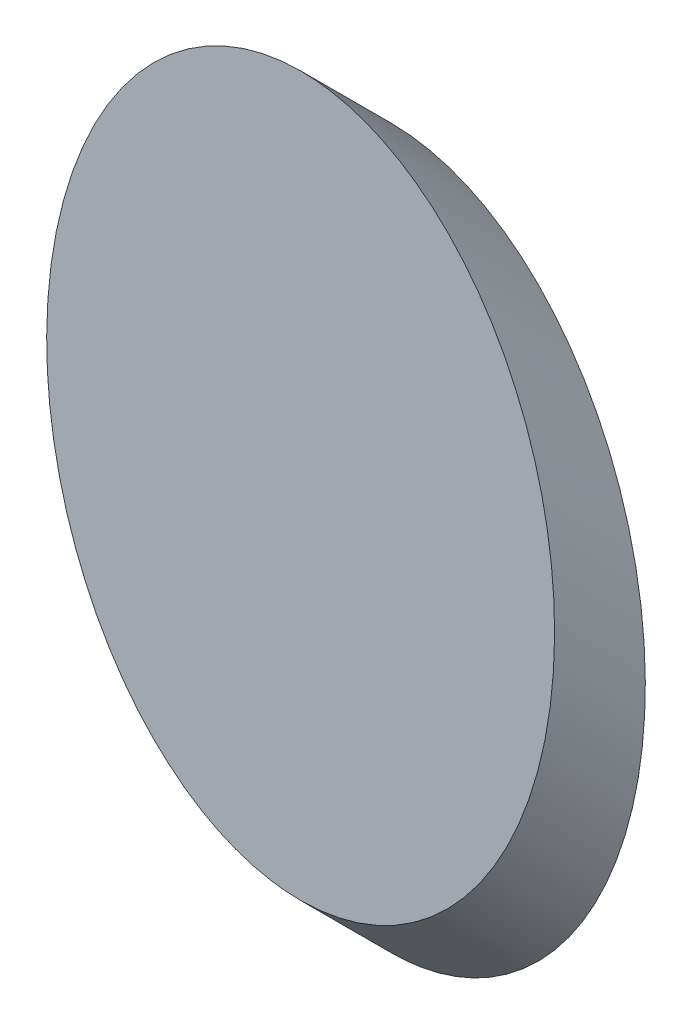
ISO-10303-21;
HEADER;
FILE_DESCRIPTION(('STEP AP214'),'2;1');
FILE_NAME('part.step','',(''),(''),'','','');
FILE_SCHEMA(('AUTOMOTIVE_DESIGN { 1 0 10303 214 1 1 1 1 }'));
ENDSEC;
DATA;
#1=APPLICATION_CONTEXT('core data for automotive mechanical design processes');
#2=APPLICATION_PROTOCOL_DEFINITION('international standard','automotive_design',2000,#1);
#3=PRODUCT_CONTEXT('',#1,'mechanical');
#4=PRODUCT('Part','Part','',(#3));
#5=PRODUCT_RELATED_PRODUCT_CATEGORY('part','',(#4));
#6=PRODUCT_DEFINITION_FORMATION('','',#4);
#7=PRODUCT_DEFINITION_CONTEXT('part definition',#1,'design');
#8=PRODUCT_DEFINITION('design','',#6,#7);
#9=PRODUCT_DEFINITION_SHAPE('','',#8);
#10=(LENGTH_UNIT() NAMED_UNIT(*) SI_UNIT(.MILLI.,.METRE.));
#11=(NAMED_UNIT(*) PLANE_ANGLE_UNIT() SI_UNIT($,.RADIAN.));
#12=(NAMED_UNIT(*) SI_UNIT($,.STERADIAN.) SOLID_ANGLE_UNIT());
#13=UNCERTAINTY_MEASURE_WITH_UNIT(LENGTH_MEASURE(1.E-05),#10,'distance_accuracy_value','');
#14=(GEOMETRIC_REPRESENTATION_CONTEXT(3) GLOBAL_UNCERTAINTY_ASSIGNED_CONTEXT((#13)) GLOBAL_UNIT_ASSIGNED_CONTEXT((#10,
#11,#12)) REPRESENTATION_CONTEXT('',''));
#15=CARTESIAN_POINT('',(0.,0.,0.));
#16=DIRECTION('',(0.,0.,1.));
#17=DIRECTION('',(1.,0.,0.));
#18=AXIS2_PLACEMENT_3D('',#15,#16,#17);
#19=CARTESIAN_POINT('',(54.3923829817161,35.7888715303221,0.));
#20=DIRECTION('',(0.,0.,1.));
#21=DIRECTION('',(1.,0.,0.));
#22=AXIS2_PLACEMENT_3D('',#19,#20,#21);
#23=PLANE('',#22);
#24=CARTESIAN_POINT('',(54.3923829817161,85.2938715303221,0.));
#25=CARTESIAN_POINT('',(54.6443985447412,85.2938728925278,0.));
#26=CARTESIAN_POINT('',(54.8963980411833,85.2900210593287,0.));
#27=CARTESIAN_POINT('',(55.4001597484142,85.2746286149493,0.));
#28=CARTESIAN_POINT('',(55.6519219614505,85.2630880773457,0.));
#29=CARTESIAN_POINT('',(56.4061621275623,85.2169835592146,0.));
#30=CARTESIAN_POINT('',(56.9079850265845,85.1709366117481,0.));
#31=CARTESIAN_POINT('',(57.9077869689775,85.0486429635089,0.));
#32=CARTESIAN_POINT('',(58.4057668175211,84.9724027739777,0.));
#33=CARTESIAN_POINT('',(59.3925580636411,84.7910939806968,0.));
#34=CARTESIAN_POINT('',(59.8814103036819,84.6862475003387,0.));
#35=CARTESIAN_POINT('',(60.8522546597314,84.448355346235,0.));
#36=CARTESIAN_POINT('',(61.3342460040687,84.3153065267928,0.));
#37=CARTESIAN_POINT('',(62.2898694689035,84.0221057479046,0.));
#38=CARTESIAN_POINT('',(62.7635016888445,83.8619541111248,0.));
#39=CARTESIAN_POINT('',(63.9018929890761,83.4416351591114,0.));
#40=CARTESIAN_POINT('',(64.5617165005626,83.16799420347,0.));
#41=CARTESIAN_POINT('',(65.8586915787453,82.5718080371783,0.));
#42=CARTESIAN_POINT('',(66.4958448099594,82.2492664261427,0.));
#43=CARTESIAN_POINT('',(67.7463755698019,81.5587427005777,0.));
#44=CARTESIAN_POINT('',(68.3597117360352,81.1906858054619,0.));
#45=CARTESIAN_POINT('',(69.5598871820921,80.4136470374011,0.));
#46=CARTESIAN_POINT('',(70.1467223854414,80.0046588991728,0.));
#47=CARTESIAN_POINT('',(71.5706549342058,78.9424359011664,0.));
#48=CARTESIAN_POINT('',(72.3911980110697,78.2668945292467,0.));
#49=CARTESIAN_POINT('',(73.9697903506671,76.8463283169203,0.));
#50=CARTESIAN_POINT('',(74.7278158550472,76.101277288125,0.));
#51=CARTESIAN_POINT('',(76.1822996640202,74.551181733507,0.));
#52=CARTESIAN_POINT('',(76.8786538686018,73.7460398424123,0.));
#53=CARTESIAN_POINT('',(78.2091834922956,72.0861800402119,0.));
#54=CARTESIAN_POINT('',(78.8433578358314,71.2314612719407,0.));
#55=CARTESIAN_POINT('',(80.2834766163629,69.1431770846754,0.));
#56=CARTESIAN_POINT('',(81.0616215729733,67.8903850663276,0.));
#57=CARTESIAN_POINT('',(82.5060829951381,65.3218784650116,0.));
#58=CARTESIAN_POINT('',(83.1723587012572,64.0061411713847,0.));
#59=CARTESIAN_POINT('',(84.3980264676188,61.3245582799203,0.));
#60=CARTESIAN_POINT('',(84.9573201673968,59.9586679327406,0.));
#61=CARTESIAN_POINT('',(85.9724417535922,57.1891338202383,0.));
#62=CARTESIAN_POINT('',(86.4282701379718,55.7854902366524,0.));
#63=CARTESIAN_POINT('',(87.1814970772061,53.1541509684229,0.));
#64=CARTESIAN_POINT('',(87.4922598007684,51.9302443755278,0.));
#65=CARTESIAN_POINT('',(88.0424637153077,49.4662283126502,0.));
#66=CARTESIAN_POINT('',(88.281888682508,48.2261152237894,0.));
#67=CARTESIAN_POINT('',(88.6907343495945,45.734313015362,0.));
#68=CARTESIAN_POINT('',(88.8601476895396,44.4826226928776,0.));
#69=CARTESIAN_POINT('',(89.1300793745773,41.9704548931022,0.));
#70=CARTESIAN_POINT('',(89.2305213596397,40.7099692322469,0.));
#71=CARTESIAN_POINT('',(89.3627906172329,38.1855662685727,0.));
#72=CARTESIAN_POINT('',(89.394626149866,36.9216493972148,0.));
#73=CARTESIAN_POINT('',(89.3898945060115,34.3939736856298,0.));
#74=CARTESIAN_POINT('',(89.3533289172044,33.1302148424156,0.));
#75=CARTESIAN_POINT('',(89.2109931647294,30.5960349025475,0.));
#76=CARTESIAN_POINT('',(89.1046496598722,29.3256458752762,0.));
#77=CARTESIAN_POINT('',(88.8215593036046,26.7926543139426,0.));
#78=CARTESIAN_POINT('',(88.6448092053139,25.5300521417072,0.));
#79=CARTESIAN_POINT('',(88.2198029930001,23.0166179116179,0.));
#80=CARTESIAN_POINT('',(87.9715312561693,21.7657884870524,0.));
#81=CARTESIAN_POINT('',(87.402503566296,19.2829211033606,0.));
#82=CARTESIAN_POINT('',(87.0818721391739,18.0508546976872,0.));
#83=CARTESIAN_POINT('',(86.3660638571956,15.608740086674,0.));
#84=CARTESIAN_POINT('',(85.9709005818881,14.3986879143532,0.));
#85=CARTESIAN_POINT('',(85.1038998503381,12.0069007798385,0.));
#86=CARTESIAN_POINT('',(84.6320985098779,10.8251527788107,0.));
#87=CARTESIAN_POINT('',(83.6260127273844,8.53503218896136,0.));
#88=CARTESIAN_POINT('',(83.0943166804122,7.42552578105183,0.));
#89=CARTESIAN_POINT('',(81.9540707724586,5.24666040622734,0.));
#90=CARTESIAN_POINT('',(81.3455269304391,4.17729830358399,0.));
#91=CARTESIAN_POINT('',(80.0495931283311,2.08889887779427,0.));
#92=CARTESIAN_POINT('',(79.3622901632763,1.06980777377196,0.));
#93=CARTESIAN_POINT('',(77.905896129219,-0.908214040107838,0.));
#94=CARTESIAN_POINT('',(77.1368256127269,-1.86715977178266,0.));
#95=CARTESIAN_POINT('',(75.7079907766956,-3.49238152079036,0.));
#96=CARTESIAN_POINT('',(75.0656969665354,-4.17404402117954,0.));
#97=CARTESIAN_POINT('',(73.732243175316,-5.48797011506033,0.));
#98=CARTESIAN_POINT('',(73.0410855477913,-6.12023608466096,0.));
#99=CARTESIAN_POINT('',(71.6109806283683,-7.32714211647898,0.));
#100=CARTESIAN_POINT('',(70.8720715900618,-7.90182738780712,0.));
#101=CARTESIAN_POINT('',(69.347480926134,-8.98560640199208,0.));
#102=CARTESIAN_POINT('',(68.5618097091627,-9.49471466219703,0.));
#103=CARTESIAN_POINT('',(67.317046698747,-10.2219768971299,0.));
#104=CARTESIAN_POINT('',(66.8732425392611,-10.466570595856,0.));
#105=CARTESIAN_POINT('',(65.9735172942795,-10.9323978152807,0.));
#106=CARTESIAN_POINT('',(65.5175969578221,-11.1536327758617,0.));
#107=CARTESIAN_POINT('',(64.5944839167033,-11.5713003841581,0.));
#108=CARTESIAN_POINT('',(64.1272903450458,-11.7677311169549,0.));
#109=CARTESIAN_POINT('',(63.1835434149852,-12.1340575964342,0.));
#110=CARTESIAN_POINT('',(62.7070080498584,-12.3039996073134,0.));
#111=CARTESIAN_POINT('',(61.7450507781631,-12.6164577368179,0.));
#112=CARTESIAN_POINT('',(61.2596294211374,-12.7589755452246,0.));
#113=CARTESIAN_POINT('',(60.2814668398238,-13.0153908154112,0.));
#114=CARTESIAN_POINT('',(59.7887286294858,-13.1292997333507,0.));
#115=CARTESIAN_POINT('',(58.8900862181598,-13.3090459610826,0.));
#116=CARTESIAN_POINT('',(58.4851765604554,-13.3798894895104,0.));
#117=CARTESIAN_POINT('',(57.6723743986767,-13.5016540773231,0.));
#118=CARTESIAN_POINT('',(57.2644819919669,-13.5525757840749,0.));
#119=CARTESIAN_POINT('',(56.4464575119767,-13.6342039837025,0.));
#120=CARTESIAN_POINT('',(56.0363243543418,-13.6648996144551,0.));
#121=CARTESIAN_POINT('',(55.2149241357862,-13.7058759006965,0.));
#122=CARTESIAN_POINT('',(54.8036567870657,-13.7161507818981,0.));
#123=CARTESIAN_POINT('',(54.392382981716,-13.7161284696779,0.));
#124=B_SPLINE_CURVE_WITH_KNOTS('',3,(#24,#25,#26,#27,#28,#29,#30,#31,#32,#33,#34,#35,#36,#37,
#38,#39,#40,#41,#42,#43,#44,#45,#46,#47,#48,#49,#50,#51,#52,#53,#54,#55,#56,#57,#58,#59,#60,#61,
#62,#63,#64,#65,#66,#67,#68,#69,#70,#71,#72,#73,#74,#75,#76,#77,#78,#79,#80,#81,#82,#83,#84,#85,
#86,#87,#88,#89,#90,#91,#92,#93,#94,#95,#96,#97,#98,#99,#100,#101,#102,#103,#104,#105,#106,#107,
#108,#109,#110,#111,#112,#113,#114,#115,#116,#117,#118,#119,#120,#121,#122,#123),.UNSPECIFIED.,
.F.,.F.,(4,2,2,2,2,2,2,2,2,2,2,2,2,2,2,2,2,2,2,2,2,2,2,2,2,2,2,2,2,2,2,2,2,2,2,2,2,2,2,2,2,2,2,
2,2,2,2,2,2,4),(0.,0.755985304328775,1.5119633743747,3.02274723751171,4.53320547392342,
6.03225355449805,7.53146892737502,9.03066645295187,11.171352723961,13.3118814938488,
15.4559750308573,17.6003972644477,20.7841451269208,23.9690973767389,27.1593271863399,
30.3496121702505,34.7674558507095,39.1869056909556,43.6103994956663,48.0338720103486,
51.8199842280139,55.6069568348979,59.3943274443868,63.1858844217277,66.9769848764245,
70.7679973357571,74.5905560083879,78.4132909830906,82.2368616097404,86.0539016505004,
89.870246905086,93.6847988922086,97.3729551506642,101.060822720038,104.744655345873,
108.427564209026,111.235058336098,114.042417331722,116.84755458519,119.652069770032,
121.171721344642,122.69127918993,124.210954275429,125.727944671985,127.244841567059,
128.761130063152,129.993842419178,131.226514714438,132.459848460263,133.693530900952),.UNSPECIFIED.);
#125=CARTESIAN_POINT('',(54.3923829817161,85.2938715303221,0.));
#126=VERTEX_POINT('',#125);
#127=CARTESIAN_POINT('',(54.392382981716,-13.7161284696779,0.));
#128=VERTEX_POINT('',#127);
#129=EDGE_CURVE('E47',#126,#128,#124,.T.);
#130=ORIENTED_EDGE('',*,*,#129,.T.);
#131=CARTESIAN_POINT('',(54.392382981716,-13.7161284696779,0.));
#132=CARTESIAN_POINT('',(54.1403674186909,-13.7161298318835,0.));
#133=CARTESIAN_POINT('',(53.8883679222488,-13.7122779986845,0.));
#134=CARTESIAN_POINT('',(53.3846062150179,-13.696885554305,0.));
#135=CARTESIAN_POINT('',(53.1328440019816,-13.6853450167015,0.));
#136=CARTESIAN_POINT('',(52.3786038358698,-13.6392404985704,0.));
#137=CARTESIAN_POINT('',(51.8767809368476,-13.5931935511039,0.));
#138=CARTESIAN_POINT('',(50.8769789944546,-13.4708999028647,0.));
#139=CARTESIAN_POINT('',(50.378999145911,-13.3946597133335,0.));
#140=CARTESIAN_POINT('',(49.392207899791,-13.2133509200526,0.));
#141=CARTESIAN_POINT('',(48.9033556597502,-13.1085044396945,0.));
#142=CARTESIAN_POINT('',(47.9325113037007,-12.8706122855908,0.));
#143=CARTESIAN_POINT('',(47.4505199593634,-12.7375634661486,0.));
#144=CARTESIAN_POINT('',(46.4948964945286,-12.4443626872604,0.));
#145=CARTESIAN_POINT('',(46.0212642745876,-12.2842110504806,0.));
#146=CARTESIAN_POINT('',(44.882872974356,-11.8638920984672,0.));
#147=CARTESIAN_POINT('',(44.2230494628695,-11.5902511428258,0.));
#148=CARTESIAN_POINT('',(42.9260743846868,-10.9940649765341,0.));
#149=CARTESIAN_POINT('',(42.2889211534728,-10.6715233654984,0.));
#150=CARTESIAN_POINT('',(41.0383903936302,-9.98099963993353,0.));
#151=CARTESIAN_POINT('',(40.425054227397,-9.61294274481765,0.));
#152=CARTESIAN_POINT('',(39.22487878134,-8.83590397675692,0.));
#153=CARTESIAN_POINT('',(38.6380435779907,-8.42691583852856,0.));
#154=CARTESIAN_POINT('',(37.2141110292263,-7.36469284052221,0.));
#155=CARTESIAN_POINT('',(36.3935679523624,-6.68915146860244,0.));
#156=CARTESIAN_POINT('',(34.814975612765,-5.26858525627603,0.));
#157=CARTESIAN_POINT('',(34.0569501083849,-4.52353422748075,0.));
#158=CARTESIAN_POINT('',(32.6024662994118,-2.9734386728628,0.));
#159=CARTESIAN_POINT('',(31.9061120948303,-2.16829678176812,0.));
#160=CARTESIAN_POINT('',(30.5755824711365,-0.508436979567625,0.));
#161=CARTESIAN_POINT('',(29.9414081276007,0.346281788703523,0.));
#162=CARTESIAN_POINT('',(28.5012893470692,2.43456597596881,0.));
#163=CARTESIAN_POINT('',(27.7231443904588,3.68735799431661,0.));
#164=CARTESIAN_POINT('',(26.2786829682939,6.25586459563269,0.));
#165=CARTESIAN_POINT('',(25.6124072621749,7.57160188925952,0.));
#166=CARTESIAN_POINT('',(24.3867394958132,10.253184780724,0.));
#167=CARTESIAN_POINT('',(23.8274457960353,11.6190751279036,0.));
#168=CARTESIAN_POINT('',(22.8123242098399,14.3886092404059,0.));
#169=CARTESIAN_POINT('',(22.3564958254603,15.7922528239919,0.));
#170=CARTESIAN_POINT('',(21.603268886226,18.4235920922214,0.));
#171=CARTESIAN_POINT('',(21.2925061626636,19.6474986851165,0.));
#172=CARTESIAN_POINT('',(20.7423022481244,22.1115147479941,0.));
#173=CARTESIAN_POINT('',(20.5028772809241,23.3516278368549,0.));
#174=CARTESIAN_POINT('',(20.0940316138375,25.8434300452823,0.));
#175=CARTESIAN_POINT('',(19.9246182738925,27.0951203677667,0.));
#176=CARTESIAN_POINT('',(19.6546865888547,29.6072881675421,0.));
#177=CARTESIAN_POINT('',(19.5542446037924,30.8677738283974,0.));
#178=CARTESIAN_POINT('',(19.4219753461992,33.3921767920716,0.));
#179=CARTESIAN_POINT('',(19.3901398135661,34.6560936634295,0.));
#180=CARTESIAN_POINT('',(19.3948714574205,37.1837693750145,0.));
#181=CARTESIAN_POINT('',(19.4314370462277,38.4475282182287,0.));
#182=CARTESIAN_POINT('',(19.5737727987027,40.9817081580968,0.));
#183=CARTESIAN_POINT('',(19.68011630356,42.2520971853681,0.));
#184=CARTESIAN_POINT('',(19.9632066598275,44.7850887467017,0.));
#185=CARTESIAN_POINT('',(20.1399567581182,46.0476909189371,0.));
#186=CARTESIAN_POINT('',(20.564962970432,48.5611251490264,0.));
#187=CARTESIAN_POINT('',(20.8132347072628,49.8119545735919,0.));
#188=CARTESIAN_POINT('',(21.3822623971361,52.2948219572836,0.));
#189=CARTESIAN_POINT('',(21.7028938242582,53.5268883629571,0.));
#190=CARTESIAN_POINT('',(22.4187021062366,55.9690029739703,0.));
#191=CARTESIAN_POINT('',(22.813865381544,57.1790551462911,0.));
#192=CARTESIAN_POINT('',(23.680866113094,59.5708422808058,0.));
#193=CARTESIAN_POINT('',(24.1526674535542,60.7525902818336,0.));
#194=CARTESIAN_POINT('',(25.1587532360478,63.0427108716829,0.));
#195=CARTESIAN_POINT('',(25.69044928302,64.1522172795925,0.));
#196=CARTESIAN_POINT('',(26.8306951909735,66.3310826544169,0.));
#197=CARTESIAN_POINT('',(27.439239032993,67.4004447570603,0.));
#198=CARTESIAN_POINT('',(28.735172835101,69.48884418285,0.));
#199=CARTESIAN_POINT('',(29.4224758001559,70.5079352868723,0.));
#200=CARTESIAN_POINT('',(30.8788698342131,72.4859571007521,0.));
#201=CARTESIAN_POINT('',(31.6479403507053,73.4449028324269,0.));
#202=CARTESIAN_POINT('',(33.0767751867366,75.0701245814346,0.));
#203=CARTESIAN_POINT('',(33.7190689968967,75.7517870818238,0.));
#204=CARTESIAN_POINT('',(35.0525227881161,77.0657131757046,0.));
#205=CARTESIAN_POINT('',(35.7436804156409,77.6979791453052,0.));
#206=CARTESIAN_POINT('',(37.1737853350638,78.9048851771232,0.));
#207=CARTESIAN_POINT('',(37.9126943733704,79.4795704484513,0.));
#208=CARTESIAN_POINT('',(39.4372850372982,80.5633494626363,0.));
#209=CARTESIAN_POINT('',(40.2229562542694,81.0724577228413,0.));
#210=CARTESIAN_POINT('',(41.4677192646851,81.7997199577741,0.));
#211=CARTESIAN_POINT('',(41.9115234241711,82.0443136565002,0.));
#212=CARTESIAN_POINT('',(42.8112486691526,82.5101408759249,0.));
#213=CARTESIAN_POINT('',(43.26716900561,82.7313758365059,0.));
#214=CARTESIAN_POINT('',(44.1902820467288,83.1490434448023,0.));
#215=CARTESIAN_POINT('',(44.6574756183863,83.3454741775991,0.));
#216=CARTESIAN_POINT('',(45.6012225484469,83.7118006570784,0.));
#217=CARTESIAN_POINT('',(46.0777579135737,83.8817426679576,0.));
#218=CARTESIAN_POINT('',(47.039715185269,84.1942007974621,0.));
#219=CARTESIAN_POINT('',(47.5251365422947,84.3367186058689,0.));
#220=CARTESIAN_POINT('',(48.5032991236083,84.5931338760554,0.));
#221=CARTESIAN_POINT('',(48.9960373339463,84.7070427939949,0.));
#222=CARTESIAN_POINT('',(49.8946797452723,84.8867890217268,0.));
#223=CARTESIAN_POINT('',(50.2995894029767,84.9576325501546,0.));
#224=CARTESIAN_POINT('',(51.1123915647554,85.0793971379673,0.));
#225=CARTESIAN_POINT('',(51.5202839714652,85.1303188447191,0.));
#226=CARTESIAN_POINT('',(52.3383084514554,85.2119470443468,0.));
#227=CARTESIAN_POINT('',(52.7484416090903,85.2426426750994,0.));
#228=CARTESIAN_POINT('',(53.5698418276459,85.2836189613407,0.));
#229=CARTESIAN_POINT('',(53.9811091763664,85.2938938425423,0.));
#230=CARTESIAN_POINT('',(54.3923829817161,85.2938715303221,0.));
#231=B_SPLINE_CURVE_WITH_KNOTS('',3,(#131,#132,#133,#134,#135,#136,#137,#138,#139,#140,#141,
#142,#143,#144,#145,#146,#147,#148,#149,#150,#151,#152,#153,#154,#155,#156,#157,#158,#159,#160,
#161,#162,#163,#164,#165,#166,#167,#168,#169,#170,#171,#172,#173,#174,#175,#176,#177,#178,#179,
#180,#181,#182,#183,#184,#185,#186,#187,#188,#189,#190,#191,#192,#193,#194,#195,#196,#197,#198,
#199,#200,#201,#202,#203,#204,#205,#206,#207,#208,#209,#210,#211,#212,#213,#214,#215,#216,#217,
#218,#219,#220,#221,#222,#223,#224,#225,#226,#227,#228,#229,#230),.UNSPECIFIED.,.F.,.F.,(4,2,2,
2,2,2,2,2,2,2,2,2,2,2,2,2,2,2,2,2,2,2,2,2,2,2,2,2,2,2,2,2,2,2,2,2,2,2,2,2,2,2,2,2,2,2,2,2,2,4),
(0.,0.755985304328782,1.5119633743747,3.0227472375117,4.53320547392341,6.03225355449806,
7.53146892737501,9.03066645295186,11.171352723961,13.3118814938488,15.4559750308573,
17.6003972644476,20.7841451269208,23.9690973767389,27.15932718634,30.3496121702505,
34.7674558507095,39.1869056909557,43.6103994956663,48.0338720103487,51.819984228014,
55.606956834898,59.3943274443868,63.1858844217278,66.9769848764245,70.7679973357572,
74.5905560083879,78.4132909830906,82.2368616097405,86.0539016505004,89.8702469050861,
93.6847988922087,97.3729551506643,101.060822720038,104.744655345873,108.427564209026,
111.235058336098,114.042417331722,116.84755458519,119.652069770032,121.171721344642,
122.69127918993,124.210954275429,125.727944671985,127.244841567059,128.761130063152,
129.993842419178,131.226514714438,132.459848460263,133.693530900952),.UNSPECIFIED.);
#232=EDGE_CURVE('E21',#128,#126,#231,.T.);
#233=ORIENTED_EDGE('',*,*,#232,.T.);
#234=EDGE_LOOP('',(#130,#233));
#235=FACE_BOUND('',#234,.T.);
#236=ADVANCED_FACE('F17',(#235),#23,.F.);
#237=CARTESIAN_POINT('',(54.3923829817161,97.7955194217003,12.5016478913781));
#238=CARTESIAN_POINT('',(54.3923829817161,85.2938715303221,0.));
#239=CARTESIAN_POINT('',(-15.6076170182839,97.7955194217003,12.5016478913781));
#240=CARTESIAN_POINT('',(-15.6076170182839,85.2938715303221,0.));
#241=CARTESIAN_POINT('',(-15.6076170182839,-1.21448057829968,12.5016478913781));
#242=CARTESIAN_POINT('',(-15.6076170182839,-13.7161284696779,0.));
#243=CARTESIAN_POINT('',(54.392382981716,-1.2144805782997,12.5016478913781));
#244=CARTESIAN_POINT('',(54.392382981716,-13.7161284696779,0.));
#245=(BOUNDED_SURFACE() B_SPLINE_SURFACE(3,1,((#237,#238),(#239,#240),(#241,#242),(#243,#244)),
.UNSPECIFIED.,.F.,.F.,.F.) B_SPLINE_SURFACE_WITH_KNOTS((4,4),(2,2),(0.,1.),(0.,1.),
.UNSPECIFIED.) GEOMETRIC_REPRESENTATION_ITEM() RATIONAL_B_SPLINE_SURFACE(((1.,1.),
(0.333333333333333,0.333333333333333),(0.333333333333333,0.333333333333333),(1.,1.))) REPRESENTATION_ITEM('') SURFACE());
#246=CARTESIAN_POINT('',(54.3923829817161,97.7955194217003,12.5016478913781));
#247=CARTESIAN_POINT('',(54.1403674186909,97.7955207839059,12.5016478913781));
#248=CARTESIAN_POINT('',(53.8883679222488,97.7916689507069,12.5016478913781));
#249=CARTESIAN_POINT('',(53.3846062150179,97.7762765063275,12.5016478913781));
#250=CARTESIAN_POINT('',(53.1328440019816,97.7647359687239,12.5016478913781));
#251=CARTESIAN_POINT('',(52.3786038358698,97.7186314505928,12.5016478913781));
#252=CARTESIAN_POINT('',(51.8767809368476,97.6725845031263,12.5016478913781));
#253=CARTESIAN_POINT('',(50.8769789944546,97.5502908548871,12.5016478913781));
#254=CARTESIAN_POINT('',(50.378999145911,97.4740506653559,12.5016478913781));
#255=CARTESIAN_POINT('',(49.392207899791,97.292741872075,12.5016478913781));
#256=CARTESIAN_POINT('',(48.9033556597502,97.1878953917169,12.5016478913781));
#257=CARTESIAN_POINT('',(47.9325113037007,96.9500032376132,12.5016478913781));
#258=CARTESIAN_POINT('',(47.4505199593634,96.816954418171,12.5016478913781));
#259=CARTESIAN_POINT('',(46.4948964945286,96.5237536392828,12.5016478913781));
#260=CARTESIAN_POINT('',(46.0212642745876,96.363602002503,12.5016478913781));
#261=CARTESIAN_POINT('',(44.882872974356,95.9432830504896,12.5016478913781));
#262=CARTESIAN_POINT('',(44.2230494628695,95.6696420948482,12.5016478913781));
#263=CARTESIAN_POINT('',(42.9260743846868,95.0734559285565,12.5016478913781));
#264=CARTESIAN_POINT('',(42.2889211534728,94.7509143175209,12.5016478913781));
#265=CARTESIAN_POINT('',(41.0383903936302,94.060390591956,12.5016478913781));
#266=CARTESIAN_POINT('',(40.425054227397,93.6923336968401,12.5016478913781));
#267=CARTESIAN_POINT('',(39.22487878134,92.9152949287793,12.5016478913781));
#268=CARTESIAN_POINT('',(38.6380435779907,92.506306790551,12.5016478913781));
#269=CARTESIAN_POINT('',(37.2141110292263,91.4440837925446,12.5016478913781));
#270=CARTESIAN_POINT('',(36.3935679523624,90.7685424206249,12.5016478913781));
#271=CARTESIAN_POINT('',(34.814975612765,89.3479762082985,12.5016478913781));
#272=CARTESIAN_POINT('',(34.0569501083849,88.6029251795032,12.5016478913781));
#273=CARTESIAN_POINT('',(32.6024662994119,87.0528296248852,12.5016478913781));
#274=CARTESIAN_POINT('',(31.9061120948303,86.2476877337906,12.5016478913781));
#275=CARTESIAN_POINT('',(30.5755824711365,84.5878279315901,12.5016478913781));
#276=CARTESIAN_POINT('',(29.9414081276007,83.7331091633189,12.5016478913781));
#277=CARTESIAN_POINT('',(28.5012893470692,81.6448249760537,12.5016478913781));
#278=CARTESIAN_POINT('',(27.7231443904588,80.3920329577059,12.5016478913781));
#279=CARTESIAN_POINT('',(26.278682968294,77.8235263563898,12.5016478913781));
#280=CARTESIAN_POINT('',(25.6124072621749,76.5077890627629,12.5016478913781));
#281=CARTESIAN_POINT('',(24.3867394958133,73.8262061712985,12.5016478913781));
#282=CARTESIAN_POINT('',(23.8274457960353,72.4603158241188,12.5016478913781));
#283=CARTESIAN_POINT('',(22.8123242098399,69.6907817116165,12.5016478913781));
#284=CARTESIAN_POINT('',(22.3564958254603,68.2871381280306,12.5016478913781));
#285=CARTESIAN_POINT('',(21.603268886226,65.6557988598011,12.5016478913781));
#286=CARTESIAN_POINT('',(21.2925061626637,64.431892266906,12.5016478913781));
#287=CARTESIAN_POINT('',(20.7423022481244,61.9678762040284,12.5016478913781));
#288=CARTESIAN_POINT('',(20.5028772809241,60.7277631151676,12.5016478913781));
#289=CARTESIAN_POINT('',(20.0940316138376,58.2359609067402,12.5016478913781));
#290=CARTESIAN_POINT('',(19.9246182738925,56.9842705842558,12.5016478913781));
#291=CARTESIAN_POINT('',(19.6546865888548,54.4721027844804,12.5016478913781));
#292=CARTESIAN_POINT('',(19.5542446037924,53.2116171236251,12.5016478913781));
#293=CARTESIAN_POINT('',(19.4219753461992,50.6872141599509,12.5016478913781));
#294=CARTESIAN_POINT('',(19.3901398135661,49.423297288593,12.5016478913781));
#295=CARTESIAN_POINT('',(19.3948714574205,46.895621577008,12.5016478913781));
#296=CARTESIAN_POINT('',(19.4314370462277,45.6318627337938,12.5016478913781));
#297=CARTESIAN_POINT('',(19.5737727987027,43.0976827939257,12.5016478913781));
#298=CARTESIAN_POINT('',(19.68011630356,41.8272937666544,12.5016478913781));
#299=CARTESIAN_POINT('',(19.9632066598275,39.2943022053208,12.5016478913781));
#300=CARTESIAN_POINT('',(20.1399567581182,38.0317000330854,12.5016478913781));
#301=CARTESIAN_POINT('',(20.564962970432,35.5182658029961,12.5016478913781));
#302=CARTESIAN_POINT('',(20.8132347072628,34.2674363784306,12.5016478913781));
#303=CARTESIAN_POINT('',(21.3822623971361,31.7845689947388,12.5016478913781));
#304=CARTESIAN_POINT('',(21.7028938242582,30.5525025890654,12.5016478913781));
#305=CARTESIAN_POINT('',(22.4187021062365,28.1103879780522,12.5016478913781));
#306=CARTESIAN_POINT('',(22.8138653815439,26.9003358057313,12.5016478913781));
#307=CARTESIAN_POINT('',(23.680866113094,24.5085486712167,12.5016478913781));
#308=CARTESIAN_POINT('',(24.1526674535542,23.3268006701889,12.5016478913781));
#309=CARTESIAN_POINT('',(25.1587532360477,21.0366800803396,12.5016478913781));
#310=CARTESIAN_POINT('',(25.6904492830199,19.92717367243,12.5016478913781));
#311=CARTESIAN_POINT('',(26.8306951909735,17.7483082976055,12.5016478913781));
#312=CARTESIAN_POINT('',(27.439239032993,16.6789461949622,12.5016478913781));
#313=CARTESIAN_POINT('',(28.735172835101,14.5905467691725,12.5016478913781));
#314=CARTESIAN_POINT('',(29.4224758001558,13.5714556651501,12.5016478913781));
#315=CARTESIAN_POINT('',(30.8788698342131,11.5934338512703,12.5016478913781));
#316=CARTESIAN_POINT('',(31.6479403507053,10.6344881195955,12.5016478913781));
#317=CARTESIAN_POINT('',(33.0767751867366,9.00926637058784,12.5016478913781));
#318=CARTESIAN_POINT('',(33.7190689968967,8.32760387019866,12.5016478913781));
#319=CARTESIAN_POINT('',(35.0525227881161,7.01367777631786,12.5016478913781));
#320=CARTESIAN_POINT('',(35.7436804156409,6.38141180671723,12.5016478913781));
#321=CARTESIAN_POINT('',(37.1737853350638,5.17450577489922,12.5016478913781));
#322=CARTESIAN_POINT('',(37.9126943733704,4.59982050357109,12.5016478913781));
#323=CARTESIAN_POINT('',(39.4372850372982,3.51604148938614,12.5016478913781));
#324=CARTESIAN_POINT('',(40.2229562542694,3.00693322918119,12.5016478913781));
#325=CARTESIAN_POINT('',(41.4677192646851,2.27967099424832,12.5016478913781));
#326=CARTESIAN_POINT('',(41.911523424171,2.03507729552219,12.5016478913781));
#327=CARTESIAN_POINT('',(42.8112486691526,1.5692500760975,12.5016478913781));
#328=CARTESIAN_POINT('',(43.26716900561,1.3480151155165,12.5016478913781));
#329=CARTESIAN_POINT('',(44.1902820467288,0.930347507220117,12.5016478913781));
#330=CARTESIAN_POINT('',(44.6574756183863,0.733916774423347,12.5016478913781));
#331=CARTESIAN_POINT('',(45.6012225484469,0.367590294944002,12.5016478913781));
#332=CARTESIAN_POINT('',(46.0777579135737,0.197648284064775,12.5016478913781));
#333=CARTESIAN_POINT('',(47.0397151852689,-0.114809845439731,12.5016478913781));
#334=CARTESIAN_POINT('',(47.5251365422947,-0.257327653846439,12.5016478913781));
#335=CARTESIAN_POINT('',(48.5032991236083,-0.513742924033026,12.5016478913781));
#336=CARTESIAN_POINT('',(48.9960373339463,-0.627651841972464,12.5016478913781));
#337=CARTESIAN_POINT('',(49.8946797452723,-0.807398069704409,12.5016478913781));
#338=CARTESIAN_POINT('',(50.2995894029767,-0.87824159813219,12.5016478913781));
#339=CARTESIAN_POINT('',(51.1123915647553,-1.0000061859449,12.5016478913781));
#340=CARTESIAN_POINT('',(51.5202839714652,-1.05092789269668,12.5016478913781));
#341=CARTESIAN_POINT('',(52.3383084514553,-1.13255609232434,12.5016478913781));
#342=CARTESIAN_POINT('',(52.7484416090903,-1.16325172307692,12.5016478913781));
#343=CARTESIAN_POINT('',(53.5698418276459,-1.20422800931824,12.5016478913781));
#344=CARTESIAN_POINT('',(53.9811091763664,-1.21450289051987,12.5016478913781));
#345=CARTESIAN_POINT('',(54.392382981716,-1.2144805782997,12.5016478913781));
#346=B_SPLINE_CURVE_WITH_KNOTS('',3,(#246,#247,#248,#249,#250,#251,#252,#253,#254,#255,#256,
#257,#258,#259,#260,#261,#262,#263,#264,#265,#266,#267,#268,#269,#270,#271,#272,#273,#274,#275,
#276,#277,#278,#279,#280,#281,#282,#283,#284,#285,#286,#287,#288,#289,#290,#291,#292,#293,#294,
#295,#296,#297,#298,#299,#300,#301,#302,#303,#304,#305,#306,#307,#308,#309,#310,#311,#312,#313,
#314,#315,#316,#317,#318,#319,#320,#321,#322,#323,#324,#325,#326,#327,#328,#329,#330,#331,#332,
#333,#334,#335,#336,#337,#338,#339,#340,#341,#342,#343,#344,#345),.UNSPECIFIED.,.F.,.F.,(4,2,2,
2,2,2,2,2,2,2,2,2,2,2,2,2,2,2,2,2,2,2,2,2,2,2,2,2,2,2,2,2,2,2,2,2,2,2,2,2,2,2,2,2,2,2,2,2,2,4),
(0.,0.755985304328782,1.51196337437471,3.02274723751171,4.53320547392342,6.03225355449807,
7.53146892737502,9.03066645295188,11.171352723961,13.3118814938488,15.4559750308573,
17.6003972644476,20.7841451269208,23.9690973767389,27.1593271863399,30.3496121702505,
34.7674558507095,39.1869056909556,43.6103994956663,48.0338720103486,51.8199842280139,
55.6069568348979,59.3943274443868,63.1858844217277,66.9769848764245,70.7679973357572,
74.5905560083879,78.4132909830906,82.2368616097404,86.0539016505004,89.870246905086,
93.6847988922086,97.3729551506642,101.060822720038,104.744655345873,108.427564209026,
111.235058336098,114.042417331722,116.84755458519,119.652069770032,121.171721344642,
122.69127918993,124.210954275429,125.727944671985,127.244841567059,128.761130063152,
129.993842419178,131.226514714438,132.459848460263,133.693530900952),.UNSPECIFIED.);
#347=CARTESIAN_POINT('',(54.3923829817161,97.7955194217003,12.5016478913781));
#348=VERTEX_POINT('',#347);
#349=CARTESIAN_POINT('',(54.392382981716,-1.2144805782997,12.5016478913781));
#350=VERTEX_POINT('',#349);
#351=EDGE_CURVE('E30',#348,#350,#346,.T.);
#352=DIRECTION('',(0.,-0.70710678118655,-0.707106781186545));
#353=VECTOR('',#352,1.);
#354=CARTESIAN_POINT('',(54.3923829817161,91.5446954760112,6.25082394568906));
#355=LINE('',#354,#353);
#356=EDGE_CURVE('E49',#348,#126,#355,.T.);
#357=DIRECTION('',(0.,0.70710678118655,0.707106781186545));
#358=VECTOR('',#357,1.);
#359=CARTESIAN_POINT('',(54.392382981716,-7.4653045239888,6.25082394568906));
#360=LINE('',#359,#358);
#361=EDGE_CURVE('E39',#128,#350,#360,.T.);
#362=ORIENTED_EDGE('',*,*,#351,.F.);
#363=ORIENTED_EDGE('',*,*,#356,.T.);
#364=ORIENTED_EDGE('',*,*,#232,.F.);
#365=ORIENTED_EDGE('',*,*,#361,.T.);
#366=EDGE_LOOP('',(#362,#363,#364,#365));
#367=FACE_BOUND('',#366,.T.);
#368=ADVANCED_FACE('F51',(#367),#245,.F.);
#369=CARTESIAN_POINT('',(54.392382981716,-1.2144805782997,12.5016478913781));
#370=CARTESIAN_POINT('',(54.392382981716,-13.7161284696779,0.));
#371=CARTESIAN_POINT('',(124.392382981716,-1.21448057829971,12.5016478913781));
#372=CARTESIAN_POINT('',(124.392382981716,-13.7161284696779,0.));
#373=CARTESIAN_POINT('',(124.392382981716,97.7955194217003,12.5016478913781));
#374=CARTESIAN_POINT('',(124.392382981716,85.2938715303221,0.));
#375=CARTESIAN_POINT('',(54.3923829817161,97.7955194217003,12.5016478913781));
#376=CARTESIAN_POINT('',(54.3923829817161,85.2938715303221,0.));
#377=(BOUNDED_SURFACE() B_SPLINE_SURFACE(3,1,((#369,#370),(#371,#372),(#373,#374),(#375,#376)),
.UNSPECIFIED.,.F.,.F.,.F.) B_SPLINE_SURFACE_WITH_KNOTS((4,4),(2,2),(0.,1.),(0.,1.),
.UNSPECIFIED.) GEOMETRIC_REPRESENTATION_ITEM() RATIONAL_B_SPLINE_SURFACE(((1.,1.),
(0.333333333333333,0.333333333333333),(0.333333333333333,0.333333333333333),(1.,1.))) REPRESENTATION_ITEM('') SURFACE());
#378=CARTESIAN_POINT('',(54.392382981716,-1.2144805782997,12.5016478913781));
#379=CARTESIAN_POINT('',(54.6443985447412,-1.21448194050533,12.5016478913781));
#380=CARTESIAN_POINT('',(54.8963980411833,-1.21063010730632,12.5016478913781));
#381=CARTESIAN_POINT('',(55.4001597484142,-1.19523766292685,12.5016478913781));
#382=CARTESIAN_POINT('',(55.6519219614505,-1.18369712532328,12.5016478913781));
#383=CARTESIAN_POINT('',(56.4061621275622,-1.13759260719221,12.5016478913781));
#384=CARTESIAN_POINT('',(56.9079850265845,-1.09154565972567,12.5016478913781));
#385=CARTESIAN_POINT('',(57.9077869689775,-0.969252011486481,12.5016478913781));
#386=CARTESIAN_POINT('',(58.4057668175211,-0.893011821955298,12.5016478913781));
#387=CARTESIAN_POINT('',(59.3925580636411,-0.711703028674445,12.5016478913781));
#388=CARTESIAN_POINT('',(59.8814103036819,-0.606856548316309,12.5016478913781));
#389=CARTESIAN_POINT('',(60.8522546597314,-0.368964394212622,12.5016478913781));
#390=CARTESIAN_POINT('',(61.3342460040687,-0.235915574770412,12.5016478913781));
#391=CARTESIAN_POINT('',(62.2898694689035,0.0572852041178005,12.5016478913781));
#392=CARTESIAN_POINT('',(62.7635016888445,0.217436840897593,12.5016478913781));
#393=CARTESIAN_POINT('',(63.9018929890761,0.63775579291102,12.5016478913781));
#394=CARTESIAN_POINT('',(64.5617165005626,0.91139674855238,12.5016478913781));
#395=CARTESIAN_POINT('',(65.8586915787453,1.50758291484415,12.5016478913781));
#396=CARTESIAN_POINT('',(66.4958448099594,1.83012452587976,12.5016478913781));
#397=CARTESIAN_POINT('',(67.7463755698019,2.52064825144468,12.5016478913781));
#398=CARTESIAN_POINT('',(68.3597117360351,2.88870514656056,12.5016478913781));
#399=CARTESIAN_POINT('',(69.5598871820921,3.6657439146213,12.5016478913781));
#400=CARTESIAN_POINT('',(70.1467223854414,4.07473205284965,12.5016478913781));
#401=CARTESIAN_POINT('',(71.5706549342058,5.136955050856,12.5016478913781));
#402=CARTESIAN_POINT('',(72.3911980110697,5.81249642277578,12.5016478913781));
#403=CARTESIAN_POINT('',(73.9697903506671,7.23306263510217,12.5016478913781));
#404=CARTESIAN_POINT('',(74.7278158550473,7.97811366389745,12.5016478913781));
#405=CARTESIAN_POINT('',(76.1822996640203,9.52820921851541,12.5016478913781));
#406=CARTESIAN_POINT('',(76.8786538686018,10.3333511096101,12.5016478913781));
#407=CARTESIAN_POINT('',(78.2091834922956,11.9932109118106,12.5016478913781));
#408=CARTESIAN_POINT('',(78.8433578358314,12.8479296800817,12.5016478913781));
#409=CARTESIAN_POINT('',(80.2834766163629,14.936213867347,12.5016478913781));
#410=CARTESIAN_POINT('',(81.0616215729733,16.1890058856948,12.5016478913781));
#411=CARTESIAN_POINT('',(82.5060829951382,18.7575124870109,12.5016478913781));
#412=CARTESIAN_POINT('',(83.1723587012572,20.0732497806377,12.5016478913781));
#413=CARTESIAN_POINT('',(84.3980264676188,22.7548326721022,12.5016478913781));
#414=CARTESIAN_POINT('',(84.9573201673968,24.1207230192818,12.5016478913781));
#415=CARTESIAN_POINT('',(85.9724417535922,26.8902571317841,12.5016478913781));
#416=CARTESIAN_POINT('',(86.4282701379718,28.2939007153701,12.5016478913781));
#417=CARTESIAN_POINT('',(87.1814970772061,30.9252399835995,12.5016478913781));
#418=CARTESIAN_POINT('',(87.4922598007684,32.1491465764947,12.5016478913781));
#419=CARTESIAN_POINT('',(88.0424637153077,34.6131626393722,12.5016478913781));
#420=CARTESIAN_POINT('',(88.281888682508,35.8532757282331,12.5016478913781));
#421=CARTESIAN_POINT('',(88.6907343495945,38.3450779366604,12.5016478913781));
#422=CARTESIAN_POINT('',(88.8601476895395,39.5967682591449,12.5016478913781));
#423=CARTESIAN_POINT('',(89.1300793745773,42.1089360589202,12.5016478913781));
#424=CARTESIAN_POINT('',(89.2305213596397,43.3694217197756,12.5016478913781));
#425=CARTESIAN_POINT('',(89.3627906172329,45.8938246834497,12.5016478913781));
#426=CARTESIAN_POINT('',(89.3946261498661,47.1577415548077,12.5016478913781));
#427=CARTESIAN_POINT('',(89.3898945060116,49.6854172663927,12.5016478913781));
#428=CARTESIAN_POINT('',(89.3533289172044,50.9491761096068,12.5016478913781));
#429=CARTESIAN_POINT('',(89.2109931647294,53.483356049475,12.5016478913781));
#430=CARTESIAN_POINT('',(89.1046496598722,54.7537450767462,12.5016478913781));
#431=CARTESIAN_POINT('',(88.8215593036046,57.2867366380798,12.5016478913781));
#432=CARTESIAN_POINT('',(88.6448092053139,58.5493388103153,12.5016478913781));
#433=CARTESIAN_POINT('',(88.2198029930001,61.0627730404045,12.5016478913781));
#434=CARTESIAN_POINT('',(87.9715312561693,62.31360246497,12.5016478913781));
#435=CARTESIAN_POINT('',(87.402503566296,64.7964698486618,12.5016478913781));
#436=CARTESIAN_POINT('',(87.0818721391739,66.0285362543353,12.5016478913781));
#437=CARTESIAN_POINT('',(86.3660638571956,68.4706508653484,12.5016478913781));
#438=CARTESIAN_POINT('',(85.9709005818881,69.6807030376693,12.5016478913781));
#439=CARTESIAN_POINT('',(85.1038998503381,72.0724901721839,12.5016478913781));
#440=CARTESIAN_POINT('',(84.6320985098779,73.2542381732117,12.5016478913781));
#441=CARTESIAN_POINT('',(83.6260127273844,75.5443587630611,12.5016478913781));
#442=CARTESIAN_POINT('',(83.0943166804122,76.6538651709706,12.5016478913781));
#443=CARTESIAN_POINT('',(81.9540707724586,78.8327305457951,12.5016478913781));
#444=CARTESIAN_POINT('',(81.3455269304391,79.9020926484384,12.5016478913781));
#445=CARTESIAN_POINT('',(80.0495931283311,81.9904920742282,12.5016478913781));
#446=CARTESIAN_POINT('',(79.3622901632763,83.0095831782505,12.5016478913781));
#447=CARTESIAN_POINT('',(77.905896129219,84.9876049921303,12.5016478913781));
#448=CARTESIAN_POINT('',(77.1368256127268,85.9465507238051,12.5016478913781));
#449=CARTESIAN_POINT('',(75.7079907766955,87.5717724728128,12.5016478913781));
#450=CARTESIAN_POINT('',(75.0656969665354,88.253434973202,12.5016478913781));
#451=CARTESIAN_POINT('',(73.732243175316,89.5673610670828,12.5016478913781));
#452=CARTESIAN_POINT('',(73.0410855477912,90.1996270366834,12.5016478913781));
#453=CARTESIAN_POINT('',(71.6109806283683,91.4065330685014,12.5016478913781));
#454=CARTESIAN_POINT('',(70.8720715900617,91.9812183398295,12.5016478913781));
#455=CARTESIAN_POINT('',(69.347480926134,93.0649973540145,12.5016478913781));
#456=CARTESIAN_POINT('',(68.5618097091627,93.5741056142194,12.5016478913781));
#457=CARTESIAN_POINT('',(67.3170466987471,94.3013678491523,12.5016478913781));
#458=CARTESIAN_POINT('',(66.8732425392611,94.5459615478784,12.5016478913781));
#459=CARTESIAN_POINT('',(65.9735172942796,95.0117887673031,12.5016478913781));
#460=CARTESIAN_POINT('',(65.5175969578221,95.2330237278841,12.5016478913781));
#461=CARTESIAN_POINT('',(64.5944839167033,95.6506913361805,12.5016478913781));
#462=CARTESIAN_POINT('',(64.1272903450458,95.8471220689772,12.5016478913781));
#463=CARTESIAN_POINT('',(63.1835434149852,96.2134485484566,12.5016478913781));
#464=CARTESIAN_POINT('',(62.7070080498584,96.3833905593358,12.5016478913781));
#465=CARTESIAN_POINT('',(61.7450507781632,96.6958486888403,12.5016478913781));
#466=CARTESIAN_POINT('',(61.2596294211374,96.8383664972471,12.5016478913781));
#467=CARTESIAN_POINT('',(60.2814668398238,97.0947817674336,12.5016478913781));
#468=CARTESIAN_POINT('',(59.7887286294858,97.2086906853731,12.5016478913781));
#469=CARTESIAN_POINT('',(58.8900862181598,97.388436913105,12.5016478913781));
#470=CARTESIAN_POINT('',(58.4851765604554,97.4592804415328,12.5016478913781));
#471=CARTESIAN_POINT('',(57.6723743986768,97.5810450293455,12.5016478913781));
#472=CARTESIAN_POINT('',(57.2644819919669,97.6319667360973,12.5016478913781));
#473=CARTESIAN_POINT('',(56.4464575119768,97.713594935725,12.5016478913781));
#474=CARTESIAN_POINT('',(56.0363243543418,97.7442905664775,12.5016478913781));
#475=CARTESIAN_POINT('',(55.2149241357862,97.7852668527189,12.5016478913781));
#476=CARTESIAN_POINT('',(54.8036567870657,97.7955417339205,12.5016478913781));
#477=CARTESIAN_POINT('',(54.3923829817161,97.7955194217003,12.5016478913781));
#478=B_SPLINE_CURVE_WITH_KNOTS('',3,(#378,#379,#380,#381,#382,#383,#384,#385,#386,#387,#388,
#389,#390,#391,#392,#393,#394,#395,#396,#397,#398,#399,#400,#401,#402,#403,#404,#405,#406,#407,
#408,#409,#410,#411,#412,#413,#414,#415,#416,#417,#418,#419,#420,#421,#422,#423,#424,#425,#426,
#427,#428,#429,#430,#431,#432,#433,#434,#435,#436,#437,#438,#439,#440,#441,#442,#443,#444,#445,
#446,#447,#448,#449,#450,#451,#452,#453,#454,#455,#456,#457,#458,#459,#460,#461,#462,#463,#464,
#465,#466,#467,#468,#469,#470,#471,#472,#473,#474,#475,#476,#477),.UNSPECIFIED.,.F.,.F.,(4,2,2,
2,2,2,2,2,2,2,2,2,2,2,2,2,2,2,2,2,2,2,2,2,2,2,2,2,2,2,2,2,2,2,2,2,2,2,2,2,2,2,2,2,2,2,2,2,2,4),
(0.,0.755985304328775,1.5119633743747,3.0227472375117,4.53320547392341,6.03225355449805,
7.53146892737501,9.03066645295186,11.171352723961,13.3118814938488,15.4559750308573,
17.6003972644477,20.7841451269209,23.9690973767389,27.15932718634,30.3496121702505,
34.7674558507095,39.1869056909557,43.6103994956663,48.0338720103486,51.8199842280139,
55.606956834898,59.3943274443868,63.1858844217278,66.9769848764245,70.7679973357572,
74.5905560083879,78.4132909830906,82.2368616097405,86.0539016505004,89.8702469050861,
93.6847988922086,97.3729551506642,101.060822720038,104.744655345873,108.427564209026,
111.235058336098,114.042417331722,116.84755458519,119.652069770032,121.171721344642,
122.69127918993,124.210954275429,125.727944671985,127.244841567059,128.761130063152,
129.993842419178,131.226514714438,132.459848460263,133.693530900952),.UNSPECIFIED.);
#479=EDGE_CURVE('E10',#350,#348,#478,.T.);
#480=ORIENTED_EDGE('',*,*,#361,.F.);
#481=ORIENTED_EDGE('',*,*,#129,.F.);
#482=ORIENTED_EDGE('',*,*,#356,.F.);
#483=ORIENTED_EDGE('',*,*,#479,.F.);
#484=EDGE_LOOP('',(#480,#481,#482,#483));
#485=FACE_BOUND('',#484,.T.);
#486=ADVANCED_FACE('F55',(#485),#377,.F.);
#487=CARTESIAN_POINT('',(54.3923829817161,48.2905194217003,12.5016478913781));
#488=DIRECTION('',(0.,0.,1.));
#489=DIRECTION('',(1.,0.,0.));
#490=AXIS2_PLACEMENT_3D('',#487,#488,#489);
#491=PLANE('',#490);
#492=ORIENTED_EDGE('',*,*,#351,.T.);
#493=ORIENTED_EDGE('',*,*,#479,.T.);
#494=EDGE_LOOP('',(#492,#493));
#495=FACE_BOUND('',#494,.T.);
#496=ADVANCED_FACE('F70',(#495),#491,.T.);
#497=CLOSED_SHELL('',(#236,#368,#486,#496));
#498=MANIFOLD_SOLID_BREP('B1',#497);
#499=ADVANCED_BREP_SHAPE_REPRESENTATION('',(#18,#498),#14);
#500=SHAPE_DEFINITION_REPRESENTATION(#9,#499);
ENDSEC;
END-ISO-10303-21;
